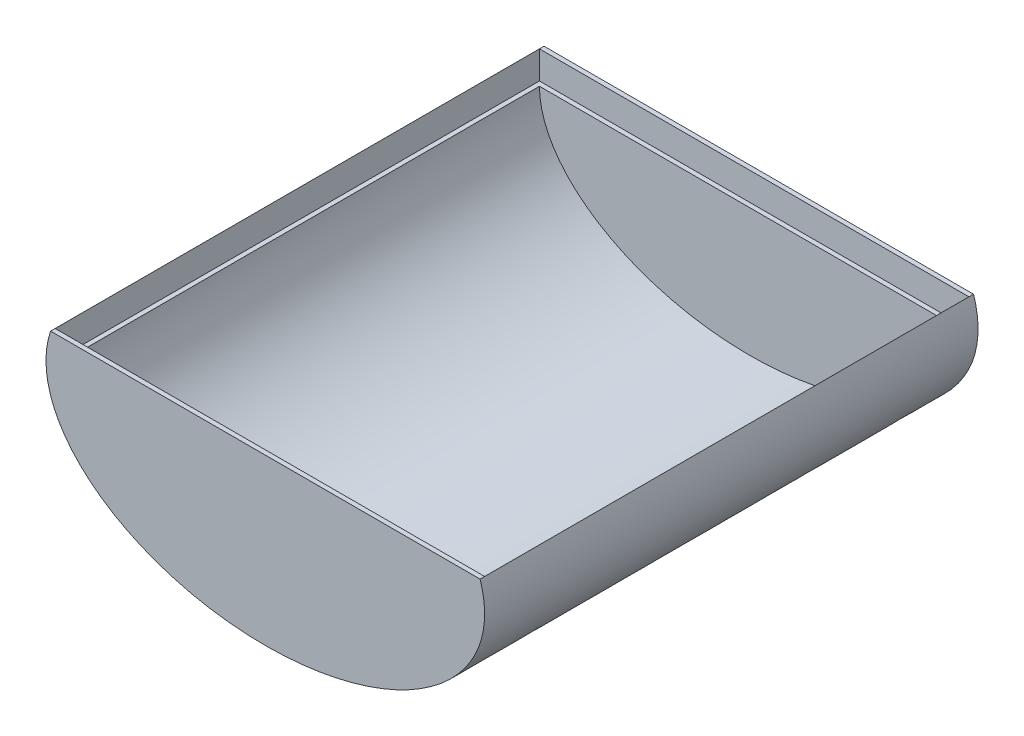
ISO-10303-21;
HEADER;
FILE_DESCRIPTION(('STEP AP214'),'2;1');
FILE_NAME('part.step','',(''),(''),'','','');
FILE_SCHEMA(('AUTOMOTIVE_DESIGN { 1 0 10303 214 1 1 1 1 }'));
ENDSEC;
DATA;
#1=APPLICATION_CONTEXT('core data for automotive mechanical design processes');
#2=APPLICATION_PROTOCOL_DEFINITION('international standard','automotive_design',2000,#1);
#3=PRODUCT_CONTEXT('',#1,'mechanical');
#4=PRODUCT('Part','Part','',(#3));
#5=PRODUCT_RELATED_PRODUCT_CATEGORY('part','',(#4));
#6=PRODUCT_DEFINITION_FORMATION('','',#4);
#7=PRODUCT_DEFINITION_CONTEXT('part definition',#1,'design');
#8=PRODUCT_DEFINITION('design','',#6,#7);
#9=PRODUCT_DEFINITION_SHAPE('','',#8);
#10=(LENGTH_UNIT() NAMED_UNIT(*) SI_UNIT(.MILLI.,.METRE.));
#11=(NAMED_UNIT(*) PLANE_ANGLE_UNIT() SI_UNIT($,.RADIAN.));
#12=(NAMED_UNIT(*) SI_UNIT($,.STERADIAN.) SOLID_ANGLE_UNIT());
#13=UNCERTAINTY_MEASURE_WITH_UNIT(LENGTH_MEASURE(1.E-05),#10,'distance_accuracy_value','');
#14=(GEOMETRIC_REPRESENTATION_CONTEXT(3) GLOBAL_UNCERTAINTY_ASSIGNED_CONTEXT((#13)) GLOBAL_UNIT_ASSIGNED_CONTEXT((#10,
#11,#12)) REPRESENTATION_CONTEXT('',''));
#15=CARTESIAN_POINT('',(0.,0.,0.));
#16=DIRECTION('',(0.,0.,1.));
#17=DIRECTION('',(1.,0.,0.));
#18=AXIS2_PLACEMENT_3D('',#15,#16,#17);
#19=CARTESIAN_POINT('',(0.,0.,0.635000000000004));
#20=DIRECTION('',(0.,0.,1.));
#21=DIRECTION('',(0.999999999999997,7.31117427778316E-08,0.));
#22=AXIS2_PLACEMENT_3D('',#19,#20,#21);
#23=ELLIPSE('',#22,14.605,8.89000000000002);
#24=DIRECTION('',(0.,0.,1.));
#25=VECTOR('',#24,1.);
#26=SURFACE_OF_LINEAR_EXTRUSION('',#23,#25);
#27=CARTESIAN_POINT('',(-14.605,0.,0.635000000000004));
#28=VERTEX_POINT('',#27);
#29=CARTESIAN_POINT('',(14.605,0.,0.635000000000004));
#30=VERTEX_POINT('',#29);
#31=EDGE_CURVE('E189',#28,#30,#23,.T.);
#32=ORIENTED_EDGE('',*,*,#31,.F.);
#33=DIRECTION('',(0.,0.,1.));
#34=VECTOR('',#33,1.);
#35=CARTESIAN_POINT('',(-14.605,0.,0.635000000000004));
#36=LINE('',#35,#34);
#37=CARTESIAN_POINT('',(-14.605,0.,33.655));
#38=VERTEX_POINT('',#37);
#39=EDGE_CURVE('E186',#38,#28,#36,.F.);
#40=ORIENTED_EDGE('',*,*,#39,.F.);
#41=CARTESIAN_POINT('',(0.,0.,33.655));
#42=DIRECTION('',(0.,0.,1.));
#43=DIRECTION('',(0.999999999999997,7.31117427778316E-08,0.));
#44=AXIS2_PLACEMENT_3D('',#41,#42,#43);
#45=ELLIPSE('',#44,14.605,8.89000000000002);
#46=CARTESIAN_POINT('',(14.605,0.,33.655));
#47=VERTEX_POINT('',#46);
#48=EDGE_CURVE('E188',#38,#47,#45,.T.);
#49=ORIENTED_EDGE('',*,*,#48,.T.);
#50=DIRECTION('',(0.,0.,1.));
#51=VECTOR('',#50,1.);
#52=CARTESIAN_POINT('',(14.605,0.,0.635000000000004));
#53=LINE('',#52,#51);
#54=EDGE_CURVE('E112',#30,#47,#53,.T.);
#55=ORIENTED_EDGE('',*,*,#54,.F.);
#56=EDGE_LOOP('',(#32,#40,#49,#55));
#57=FACE_BOUND('',#56,.T.);
#58=ADVANCED_FACE('F33',(#57),#26,.F.);
#59=CARTESIAN_POINT('',(0.,0.,0.635000000000004));
#60=DIRECTION('',(0.,0.,1.));
#61=DIRECTION('',(1.,0.,0.));
#62=AXIS2_PLACEMENT_3D('',#59,#60,#61);
#63=PLANE('',#62);
#64=DIRECTION('',(-1.,0.,0.));
#65=VECTOR('',#64,1.);
#66=CARTESIAN_POINT('',(0.,0.,0.635000000000004));
#67=LINE('',#66,#65);
#68=EDGE_CURVE('E164',#30,#28,#67,.T.);
#69=ORIENTED_EDGE('',*,*,#68,.T.);
#70=ORIENTED_EDGE('',*,*,#31,.T.);
#71=EDGE_LOOP('',(#69,#70));
#72=FACE_BOUND('',#71,.T.);
#73=ADVANCED_FACE('F197',(#72),#63,.T.);
#74=CARTESIAN_POINT('',(0.,0.,33.655));
#75=DIRECTION('',(0.,0.,1.));
#76=DIRECTION('',(1.,0.,0.));
#77=AXIS2_PLACEMENT_3D('',#74,#75,#76);
#78=PLANE('',#77);
#79=ORIENTED_EDGE('',*,*,#48,.F.);
#80=DIRECTION('',(-1.,0.,0.));
#81=VECTOR('',#80,1.);
#82=CARTESIAN_POINT('',(0.,0.,33.655));
#83=LINE('',#82,#81);
#84=EDGE_CURVE('E166',#47,#38,#83,.T.);
#85=ORIENTED_EDGE('',*,*,#84,.F.);
#86=EDGE_LOOP('',(#79,#85));
#87=FACE_BOUND('',#86,.T.);
#88=ADVANCED_FACE('F199',(#87),#78,.F.);
#89=CARTESIAN_POINT('',(0.,0.,34.29));
#90=DIRECTION('',(0.,0.,1.));
#91=DIRECTION('',(-1.,0.,0.));
#92=AXIS2_PLACEMENT_3D('',#89,#90,#91);
#93=ELLIPSE('',#92,15.24,9.525);
#94=DIRECTION('',(0.,0.,-1.));
#95=VECTOR('',#94,1.);
#96=SURFACE_OF_LINEAR_EXTRUSION('',#93,#95);
#97=DIRECTION('',(0.,0.,-1.));
#98=VECTOR('',#97,1.);
#99=CARTESIAN_POINT('',(-14.9225,1.93412950279803,34.29));
#100=LINE('',#99,#98);
#101=CARTESIAN_POINT('',(-14.9225,1.93412950279803,0.));
#102=VERTEX_POINT('',#101);
#103=CARTESIAN_POINT('',(-14.9225,1.93412950279803,0.3175));
#104=VERTEX_POINT('',#103);
#105=EDGE_CURVE('E106',#102,#104,#100,.F.);
#106=ORIENTED_EDGE('',*,*,#105,.F.);
#107=CARTESIAN_POINT('',(0.,0.,0.));
#108=DIRECTION('',(0.,0.,1.));
#109=DIRECTION('',(-1.,0.,0.));
#110=AXIS2_PLACEMENT_3D('',#107,#108,#109);
#111=ELLIPSE('',#110,15.24,9.525);
#112=CARTESIAN_POINT('',(14.9225,1.93412950279803,0.));
#113=VERTEX_POINT('',#112);
#114=EDGE_CURVE('E192',#102,#113,#111,.T.);
#115=ORIENTED_EDGE('',*,*,#114,.T.);
#116=DIRECTION('',(0.,0.,1.));
#117=VECTOR('',#116,1.);
#118=CARTESIAN_POINT('',(14.9225,1.93412950279803,-6.6675));
#119=LINE('',#118,#117);
#120=CARTESIAN_POINT('',(14.9225,1.93412950279803,0.3175));
#121=VERTEX_POINT('',#120);
#122=EDGE_CURVE('E58',#113,#121,#119,.T.);
#123=ORIENTED_EDGE('',*,*,#122,.T.);
#124=DIRECTION('',(0.,0.,1.));
#125=VECTOR('',#124,1.);
#126=CARTESIAN_POINT('',(14.9225,1.93412950279803,0.952500000000002));
#127=LINE('',#126,#125);
#128=CARTESIAN_POINT('',(14.9225,1.93412950279803,33.9725));
#129=VERTEX_POINT('',#128);
#130=EDGE_CURVE('E113',#121,#129,#127,.T.);
#131=ORIENTED_EDGE('',*,*,#130,.T.);
#132=CARTESIAN_POINT('',(14.9225,1.93412950279803,34.29));
#133=VERTEX_POINT('',#132);
#134=EDGE_CURVE('E135',#129,#133,#119,.T.);
#135=ORIENTED_EDGE('',*,*,#134,.T.);
#136=CARTESIAN_POINT('',(-14.9225,1.93412950279803,34.29));
#137=VERTEX_POINT('',#136);
#138=EDGE_CURVE('E43',#137,#133,#93,.T.);
#139=ORIENTED_EDGE('',*,*,#138,.F.);
#140=CARTESIAN_POINT('',(-14.9225,1.93412950279803,33.9725));
#141=VERTEX_POINT('',#140);
#142=EDGE_CURVE('E51',#141,#137,#100,.F.);
#143=ORIENTED_EDGE('',*,*,#142,.F.);
#144=DIRECTION('',(0.,0.,1.));
#145=VECTOR('',#144,1.);
#146=CARTESIAN_POINT('',(-14.9225,1.93412950279803,0.952500000000002));
#147=LINE('',#146,#145);
#148=EDGE_CURVE('E102',#104,#141,#147,.T.);
#149=ORIENTED_EDGE('',*,*,#148,.F.);
#150=EDGE_LOOP('',(#106,#115,#123,#131,#135,#139,#143,#149));
#151=FACE_BOUND('',#150,.T.);
#152=ADVANCED_FACE('F35',(#151),#96,.F.);
#153=CARTESIAN_POINT('',(0.,0.,34.29));
#154=DIRECTION('',(0.,0.,1.));
#155=DIRECTION('',(1.,0.,0.));
#156=AXIS2_PLACEMENT_3D('',#153,#154,#155);
#157=PLANE('',#156);
#158=ORIENTED_EDGE('',*,*,#138,.T.);
#159=DIRECTION('',(-1.,0.,0.));
#160=VECTOR('',#159,1.);
#161=CARTESIAN_POINT('',(0.,1.93412950279803,34.29));
#162=LINE('',#161,#160);
#163=EDGE_CURVE('E132',#133,#137,#162,.T.);
#164=ORIENTED_EDGE('',*,*,#163,.T.);
#165=EDGE_LOOP('',(#158,#164));
#166=FACE_BOUND('',#165,.T.);
#167=ADVANCED_FACE('F201',(#166),#157,.T.);
#168=CARTESIAN_POINT('',(0.,0.,0.));
#169=DIRECTION('',(0.,0.,1.));
#170=DIRECTION('',(1.,0.,0.));
#171=AXIS2_PLACEMENT_3D('',#168,#169,#170);
#172=PLANE('',#171);
#173=DIRECTION('',(-1.,0.,0.));
#174=VECTOR('',#173,1.);
#175=CARTESIAN_POINT('',(0.,1.93412950279803,0.));
#176=LINE('',#175,#174);
#177=EDGE_CURVE('E11',#113,#102,#176,.T.);
#178=ORIENTED_EDGE('',*,*,#177,.F.);
#179=ORIENTED_EDGE('',*,*,#114,.F.);
#180=EDGE_LOOP('',(#178,#179));
#181=FACE_BOUND('',#180,.T.);
#182=ADVANCED_FACE('F203',(#181),#172,.F.);
#183=CARTESIAN_POINT('',(0.,0.,0.952500000000002));
#184=DIRECTION('',(0.,1.,0.));
#185=DIRECTION('',(0.,0.,1.));
#186=AXIS2_PLACEMENT_3D('',#183,#184,#185);
#187=PLANE('',#186);
#188=DIRECTION('',(1.,0.,0.));
#189=VECTOR('',#188,1.);
#190=CARTESIAN_POINT('',(-14.5945132180454,0.,0.3175));
#191=LINE('',#190,#189);
#192=CARTESIAN_POINT('',(-14.9225,0.,0.3175));
#193=VERTEX_POINT('',#192);
#194=CARTESIAN_POINT('',(14.9225,0.,0.3175));
#195=VERTEX_POINT('',#194);
#196=EDGE_CURVE('E174',#193,#195,#191,.T.);
#197=ORIENTED_EDGE('',*,*,#196,.F.);
#198=DIRECTION('',(0.,0.,1.));
#199=VECTOR('',#198,1.);
#200=CARTESIAN_POINT('',(-14.9225,0.,0.952500000000002));
#201=LINE('',#200,#199);
#202=CARTESIAN_POINT('',(-14.9225,0.,33.9725));
#203=VERTEX_POINT('',#202);
#204=EDGE_CURVE('E127',#193,#203,#201,.T.);
#205=ORIENTED_EDGE('',*,*,#204,.T.);
#206=DIRECTION('',(-1.,0.,0.));
#207=VECTOR('',#206,1.);
#208=CARTESIAN_POINT('',(-14.5945132180454,0.,33.9725));
#209=LINE('',#208,#207);
#210=CARTESIAN_POINT('',(14.9225,0.,33.9725));
#211=VERTEX_POINT('',#210);
#212=EDGE_CURVE('E170',#211,#203,#209,.T.);
#213=ORIENTED_EDGE('',*,*,#212,.F.);
#214=DIRECTION('',(0.,0.,1.));
#215=VECTOR('',#214,1.);
#216=CARTESIAN_POINT('',(14.9225,0.,0.952500000000002));
#217=LINE('',#216,#215);
#218=EDGE_CURVE('E180',#195,#211,#217,.T.);
#219=ORIENTED_EDGE('',*,*,#218,.F.);
#220=EDGE_LOOP('',(#197,#205,#213,#219));
#221=FACE_BOUND('',#220,.T.);
#222=ORIENTED_EDGE('',*,*,#39,.T.);
#223=ORIENTED_EDGE('',*,*,#68,.F.);
#224=ORIENTED_EDGE('',*,*,#54,.T.);
#225=ORIENTED_EDGE('',*,*,#84,.T.);
#226=EDGE_LOOP('',(#222,#223,#224,#225));
#227=FACE_BOUND('',#226,.T.);
#228=ADVANCED_FACE('F206',(#221,#227),#187,.T.);
#229=CARTESIAN_POINT('',(-14.9225,0.,0.952500000000002));
#230=DIRECTION('',(1.,0.,0.));
#231=DIRECTION('',(0.,0.,-1.));
#232=AXIS2_PLACEMENT_3D('',#229,#230,#231);
#233=PLANE('',#232);
#234=ORIENTED_EDGE('',*,*,#148,.T.);
#235=DIRECTION('',(0.,1.,0.));
#236=VECTOR('',#235,1.);
#237=CARTESIAN_POINT('',(-14.9225,-0.456488312158069,33.9725));
#238=LINE('',#237,#236);
#239=EDGE_CURVE('E129',#203,#141,#238,.T.);
#240=ORIENTED_EDGE('',*,*,#239,.F.);
#241=ORIENTED_EDGE('',*,*,#204,.F.);
#242=DIRECTION('',(0.,1.,0.));
#243=VECTOR('',#242,1.);
#244=CARTESIAN_POINT('',(-14.9225,-0.714702965669596,0.3175));
#245=LINE('',#244,#243);
#246=EDGE_CURVE('E121',#193,#104,#245,.T.);
#247=ORIENTED_EDGE('',*,*,#246,.T.);
#248=EDGE_LOOP('',(#234,#240,#241,#247));
#249=FACE_BOUND('',#248,.T.);
#250=ADVANCED_FACE('F126',(#249),#233,.T.);
#251=CARTESIAN_POINT('',(14.9225,0.,0.952500000000002));
#252=DIRECTION('',(1.,0.,0.));
#253=DIRECTION('',(0.,0.,-1.));
#254=AXIS2_PLACEMENT_3D('',#251,#252,#253);
#255=PLANE('',#254);
#256=ORIENTED_EDGE('',*,*,#218,.T.);
#257=DIRECTION('',(0.,1.,0.));
#258=VECTOR('',#257,1.);
#259=CARTESIAN_POINT('',(14.9225,-44.7650878957505,33.9725));
#260=LINE('',#259,#258);
#261=EDGE_CURVE('E124',#211,#129,#260,.T.);
#262=ORIENTED_EDGE('',*,*,#261,.T.);
#263=ORIENTED_EDGE('',*,*,#130,.F.);
#264=DIRECTION('',(0.,1.,0.));
#265=VECTOR('',#264,1.);
#266=CARTESIAN_POINT('',(14.9225,-44.7650878957505,0.3175));
#267=LINE('',#266,#265);
#268=EDGE_CURVE('E123',#195,#121,#267,.T.);
#269=ORIENTED_EDGE('',*,*,#268,.F.);
#270=EDGE_LOOP('',(#256,#262,#263,#269));
#271=FACE_BOUND('',#270,.T.);
#272=ADVANCED_FACE('F179',(#271),#255,.F.);
#273=CARTESIAN_POINT('',(14.9225,1.93412950279803,-6.6675));
#274=DIRECTION('',(0.,1.,0.));
#275=DIRECTION('',(0.,0.,1.));
#276=AXIS2_PLACEMENT_3D('',#273,#274,#275);
#277=PLANE('',#276);
#278=ORIENTED_EDGE('',*,*,#105,.T.);
#279=DIRECTION('',(-1.,0.,0.));
#280=VECTOR('',#279,1.);
#281=CARTESIAN_POINT('',(-14.5945132180454,1.93412950279803,0.3175));
#282=LINE('',#281,#280);
#283=EDGE_CURVE('E118',#121,#104,#282,.T.);
#284=ORIENTED_EDGE('',*,*,#283,.F.);
#285=ORIENTED_EDGE('',*,*,#122,.F.);
#286=ORIENTED_EDGE('',*,*,#177,.T.);
#287=EDGE_LOOP('',(#278,#284,#285,#286));
#288=FACE_BOUND('',#287,.T.);
#289=ADVANCED_FACE('F131',(#288),#277,.T.);
#290=DIRECTION('',(1.,0.,0.));
#291=VECTOR('',#290,1.);
#292=CARTESIAN_POINT('',(-14.5945132180454,1.93412950279803,33.9725));
#293=LINE('',#292,#291);
#294=EDGE_CURVE('E125',#141,#129,#293,.T.);
#295=ORIENTED_EDGE('',*,*,#294,.F.);
#296=ORIENTED_EDGE('',*,*,#142,.T.);
#297=ORIENTED_EDGE('',*,*,#163,.F.);
#298=ORIENTED_EDGE('',*,*,#134,.F.);
#299=EDGE_LOOP('',(#295,#296,#297,#298));
#300=FACE_BOUND('',#299,.T.);
#301=ADVANCED_FACE('F162',(#300),#277,.T.);
#302=CARTESIAN_POINT('',(-14.5945132180454,-44.7650878957505,33.9725));
#303=DIRECTION('',(0.,0.,1.));
#304=DIRECTION('',(1.,0.,0.));
#305=AXIS2_PLACEMENT_3D('',#302,#303,#304);
#306=PLANE('',#305);
#307=ORIENTED_EDGE('',*,*,#212,.T.);
#308=ORIENTED_EDGE('',*,*,#239,.T.);
#309=ORIENTED_EDGE('',*,*,#294,.T.);
#310=ORIENTED_EDGE('',*,*,#261,.F.);
#311=EDGE_LOOP('',(#307,#308,#309,#310));
#312=FACE_BOUND('',#311,.T.);
#313=ADVANCED_FACE('F159',(#312),#306,.F.);
#314=CARTESIAN_POINT('',(-14.5945132180454,-44.7650878957505,0.3175));
#315=DIRECTION('',(0.,0.,-1.));
#316=DIRECTION('',(-1.,0.,0.));
#317=AXIS2_PLACEMENT_3D('',#314,#315,#316);
#318=PLANE('',#317);
#319=ORIENTED_EDGE('',*,*,#196,.T.);
#320=ORIENTED_EDGE('',*,*,#268,.T.);
#321=ORIENTED_EDGE('',*,*,#283,.T.);
#322=ORIENTED_EDGE('',*,*,#246,.F.);
#323=EDGE_LOOP('',(#319,#320,#321,#322));
#324=FACE_BOUND('',#323,.T.);
#325=ADVANCED_FACE('F120',(#324),#318,.F.);
#326=CLOSED_SHELL('',(#58,#73,#88,#152,#167,#182,#228,#250,#272,#289,#301,#313,#325));
#327=MANIFOLD_SOLID_BREP('B2',#326);
#328=ADVANCED_BREP_SHAPE_REPRESENTATION('',(#18,#327),#14);
#329=SHAPE_DEFINITION_REPRESENTATION(#9,#328);
ENDSEC;
END-ISO-10303-21;
